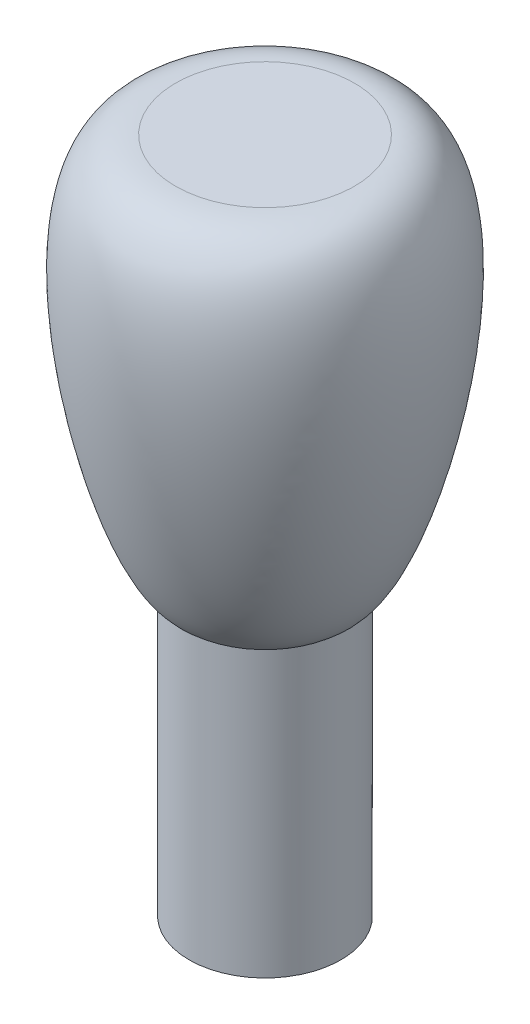
ISO-10303-21;
HEADER;
FILE_DESCRIPTION(('STEP AP214'),'2;1');
FILE_NAME('part.step','',(''),(''),'','','');
FILE_SCHEMA(('AUTOMOTIVE_DESIGN { 1 0 10303 214 1 1 1 1 }'));
ENDSEC;
DATA;
#1=APPLICATION_CONTEXT('core data for automotive mechanical design processes');
#2=APPLICATION_PROTOCOL_DEFINITION('international standard','automotive_design',2000,#1);
#3=PRODUCT_CONTEXT('',#1,'mechanical');
#4=PRODUCT('Part','Part','',(#3));
#5=PRODUCT_RELATED_PRODUCT_CATEGORY('part','',(#4));
#6=PRODUCT_DEFINITION_FORMATION('','',#4);
#7=PRODUCT_DEFINITION_CONTEXT('part definition',#1,'design');
#8=PRODUCT_DEFINITION('design','',#6,#7);
#9=PRODUCT_DEFINITION_SHAPE('','',#8);
#10=(LENGTH_UNIT() NAMED_UNIT(*) SI_UNIT(.MILLI.,.METRE.));
#11=(NAMED_UNIT(*) PLANE_ANGLE_UNIT() SI_UNIT($,.RADIAN.));
#12=(NAMED_UNIT(*) SI_UNIT($,.STERADIAN.) SOLID_ANGLE_UNIT());
#13=UNCERTAINTY_MEASURE_WITH_UNIT(LENGTH_MEASURE(1.E-05),#10,'distance_accuracy_value','');
#14=(GEOMETRIC_REPRESENTATION_CONTEXT(3) GLOBAL_UNCERTAINTY_ASSIGNED_CONTEXT((#13)) GLOBAL_UNIT_ASSIGNED_CONTEXT((#10,
#11,#12)) REPRESENTATION_CONTEXT('',''));
#15=CARTESIAN_POINT('',(0.,0.,0.));
#16=DIRECTION('',(0.,0.,1.));
#17=DIRECTION('',(1.,0.,0.));
#18=AXIS2_PLACEMENT_3D('',#15,#16,#17);
#19=CARTESIAN_POINT('',(0.,0.,0.));
#20=DIRECTION('',(0.,1.,0.));
#21=DIRECTION('',(0.,0.,1.));
#22=AXIS2_PLACEMENT_3D('',#19,#20,#21);
#23=PLANE('',#22);
#24=CARTESIAN_POINT('',(0.,0.,0.));
#25=DIRECTION('',(0.,1.,0.));
#26=DIRECTION('',(0.,0.,1.));
#27=AXIS2_PLACEMENT_3D('',#24,#25,#26);
#28=CIRCLE('',#27,2.4);
#29=CARTESIAN_POINT('',(-1.87349939951952,0.,-1.5));
#30=VERTEX_POINT('',#29);
#31=CARTESIAN_POINT('',(1.87349939951952,0.,-1.5));
#32=VERTEX_POINT('',#31);
#33=EDGE_CURVE('E11',#30,#32,#28,.T.);
#34=ORIENTED_EDGE('',*,*,#33,.F.);
#35=DIRECTION('',(-1.,0.,0.));
#36=VECTOR('',#35,1.);
#37=CARTESIAN_POINT('',(-1.87349939951952,0.,-1.5));
#38=LINE('',#37,#36);
#39=EDGE_CURVE('E65',#32,#30,#38,.T.);
#40=ORIENTED_EDGE('',*,*,#39,.F.);
#41=EDGE_LOOP('',(#34,#40));
#42=FACE_BOUND('',#41,.T.);
#43=ADVANCED_FACE('F37',(#42),#23,.F.);
#44=CARTESIAN_POINT('',(0.,21.3768135954274,0.));
#45=DIRECTION('',(0.,1.,0.));
#46=DIRECTION('',(0.,0.,1.));
#47=AXIS2_PLACEMENT_3D('',#44,#45,#46);
#48=CYLINDRICAL_SURFACE('',#47,2.4);
#49=ORIENTED_EDGE('',*,*,#33,.T.);
#50=DIRECTION('',(0.,-1.,0.));
#51=VECTOR('',#50,1.);
#52=CARTESIAN_POINT('',(1.87349939951952,3.,-1.5));
#53=LINE('',#52,#51);
#54=CARTESIAN_POINT('',(1.87349939951952,3.,-1.5));
#55=VERTEX_POINT('',#54);
#56=EDGE_CURVE('E62',#55,#32,#53,.T.);
#57=ORIENTED_EDGE('',*,*,#56,.F.);
#58=CARTESIAN_POINT('',(0.,3.,0.));
#59=DIRECTION('',(0.,-1.,0.));
#60=DIRECTION('',(1.,0.,0.));
#61=AXIS2_PLACEMENT_3D('',#58,#59,#60);
#62=CIRCLE('',#61,2.4);
#63=CARTESIAN_POINT('',(-1.87349939951952,3.,-1.5));
#64=VERTEX_POINT('',#63);
#65=EDGE_CURVE('E55',#64,#55,#62,.T.);
#66=ORIENTED_EDGE('',*,*,#65,.F.);
#67=DIRECTION('',(0.,-1.,0.));
#68=VECTOR('',#67,1.);
#69=CARTESIAN_POINT('',(-1.87349939951952,3.,-1.5));
#70=LINE('',#69,#68);
#71=EDGE_CURVE('E68',#64,#30,#70,.T.);
#72=ORIENTED_EDGE('',*,*,#71,.T.);
#73=EDGE_LOOP('',(#49,#57,#66,#72));
#74=FACE_BOUND('',#73,.T.);
#75=CARTESIAN_POINT('',(0.,9.,0.));
#76=DIRECTION('',(0.,1.,0.));
#77=DIRECTION('',(0.,0.,1.));
#78=AXIS2_PLACEMENT_3D('',#75,#76,#77);
#79=CIRCLE('',#78,2.4);
#80=CARTESIAN_POINT('',(0.,9.,2.4));
#81=VERTEX_POINT('',#80);
#82=EDGE_CURVE('E44',#81,#81,#79,.T.);
#83=ORIENTED_EDGE('',*,*,#82,.F.);
#84=EDGE_LOOP('',(#83));
#85=FACE_BOUND('',#84,.T.);
#86=ADVANCED_FACE('F73',(#74,#85),#48,.T.);
#87=CARTESIAN_POINT('',(2.4,9.,0.));
#88=CARTESIAN_POINT('',(3.9436241442031,9.64011289194505,0.));
#89=CARTESIAN_POINT('',(6.67821871170641,21.0057400327643,0.));
#90=CARTESIAN_POINT('',(2.23867002024906,21.4612914213764,0.));
#91=CARTESIAN_POINT('',(0.753276848903558,21.008863182939,0.));
#92=CARTESIAN_POINT('',(0.,21.3768135954274,0.));
#93=B_SPLINE_CURVE_WITH_KNOTS('',3,(#87,#88,#89,#90,#91,#92),.UNSPECIFIED.,.F.,.F.,(4,1,1,4),
(0.,0.773199913681035,0.826737293532174,1.),.UNSPECIFIED.);
#94=CARTESIAN_POINT('',(0.,21.3768135954274,0.));
#95=DIRECTION('',(0.,1.,0.));
#96=AXIS1_PLACEMENT('',#94,#95);
#97=SURFACE_OF_REVOLUTION('',#93,#96);
#98=CARTESIAN_POINT('',(0.,21.3768135954274,0.));
#99=DIRECTION('',(0.,1.,0.));
#100=DIRECTION('',(0.,0.,1.));
#101=AXIS2_PLACEMENT_3D('',#98,#99,#100);
#102=CIRCLE('',#101,2.82482957264818);
#103=CARTESIAN_POINT('',(0.,21.3768135954274,2.82482957264818));
#104=VERTEX_POINT('',#103);
#105=EDGE_CURVE('E75',#104,#104,#102,.T.);
#106=ORIENTED_EDGE('',*,*,#105,.F.);
#107=EDGE_LOOP('',(#106));
#108=FACE_BOUND('',#107,.T.);
#109=ORIENTED_EDGE('',*,*,#82,.T.);
#110=EDGE_LOOP('',(#109));
#111=FACE_BOUND('',#110,.T.);
#112=ADVANCED_FACE('F88',(#108,#111),#97,.T.);
#113=CARTESIAN_POINT('',(0.,21.3768135954274,0.));
#114=DIRECTION('',(0.,1.,0.));
#115=DIRECTION('',(0.,0.,1.));
#116=AXIS2_PLACEMENT_3D('',#113,#114,#115);
#117=PLANE('',#116);
#118=ORIENTED_EDGE('',*,*,#105,.T.);
#119=EDGE_LOOP('',(#118));
#120=FACE_BOUND('',#119,.T.);
#121=ADVANCED_FACE('F91',(#120),#117,.T.);
#122=CARTESIAN_POINT('',(-1.87349939951952,3.,-1.5));
#123=DIRECTION('',(0.,0.,1.));
#124=DIRECTION('',(1.,0.,0.));
#125=AXIS2_PLACEMENT_3D('',#122,#123,#124);
#126=PLANE('',#125);
#127=ORIENTED_EDGE('',*,*,#39,.T.);
#128=ORIENTED_EDGE('',*,*,#71,.F.);
#129=DIRECTION('',(-1.,0.,0.));
#130=VECTOR('',#129,1.);
#131=CARTESIAN_POINT('',(-1.87349939951952,3.,-1.5));
#132=LINE('',#131,#130);
#133=EDGE_CURVE('E50',#55,#64,#132,.T.);
#134=ORIENTED_EDGE('',*,*,#133,.F.);
#135=ORIENTED_EDGE('',*,*,#56,.T.);
#136=EDGE_LOOP('',(#127,#128,#134,#135));
#137=FACE_BOUND('',#136,.T.);
#138=ADVANCED_FACE('F64',(#137),#126,.F.);
#139=CARTESIAN_POINT('',(0.,3.,0.));
#140=DIRECTION('',(0.,-1.,0.));
#141=DIRECTION('',(1.,0.,0.));
#142=AXIS2_PLACEMENT_3D('',#139,#140,#141);
#143=PLANE('',#142);
#144=ORIENTED_EDGE('',*,*,#65,.T.);
#145=ORIENTED_EDGE('',*,*,#133,.T.);
#146=EDGE_LOOP('',(#144,#145));
#147=FACE_BOUND('',#146,.T.);
#148=ADVANCED_FACE('F119',(#147),#143,.T.);
#149=CLOSED_SHELL('',(#43,#86,#112,#121,#138,#148));
#150=MANIFOLD_SOLID_BREP('B2',#149);
#151=ADVANCED_BREP_SHAPE_REPRESENTATION('',(#18,#150),#14);
#152=SHAPE_DEFINITION_REPRESENTATION(#9,#151);
ENDSEC;
END-ISO-10303-21;
